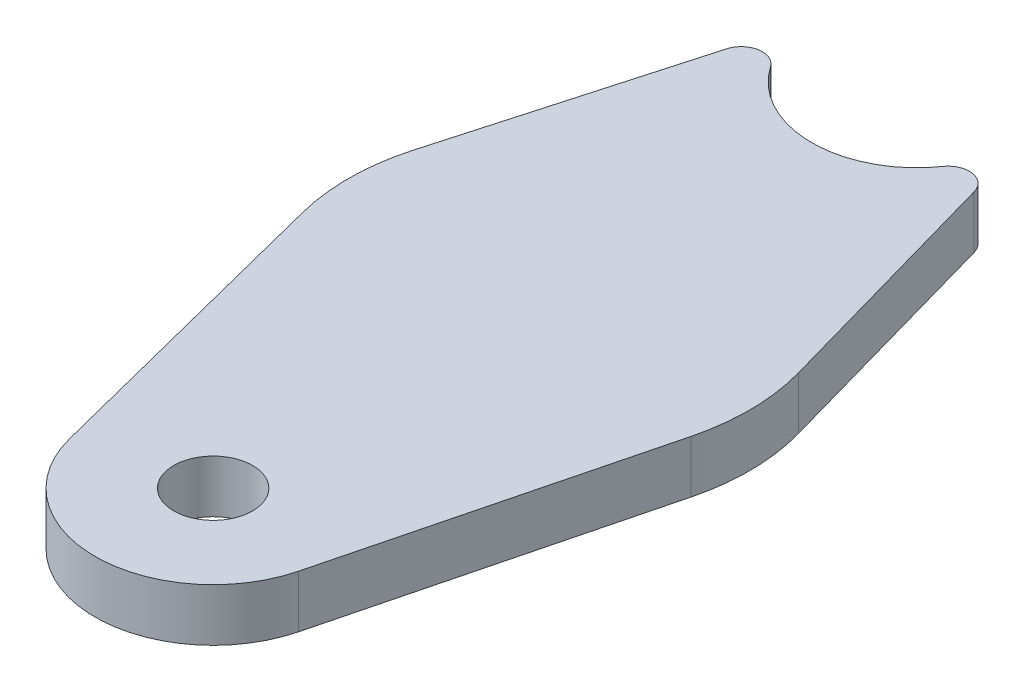
ISO-10303-21;
HEADER;
FILE_DESCRIPTION(('STEP AP214'),'2;1');
FILE_NAME('part.step','',(''),(''),'','','');
FILE_SCHEMA(('AUTOMOTIVE_DESIGN { 1 0 10303 214 1 1 1 1 }'));
ENDSEC;
DATA;
#1=APPLICATION_CONTEXT('core data for automotive mechanical design processes');
#2=APPLICATION_PROTOCOL_DEFINITION('international standard','automotive_design',2000,#1);
#3=PRODUCT_CONTEXT('',#1,'mechanical');
#4=PRODUCT('Part','Part','',(#3));
#5=PRODUCT_RELATED_PRODUCT_CATEGORY('part','',(#4));
#6=PRODUCT_DEFINITION_FORMATION('','',#4);
#7=PRODUCT_DEFINITION_CONTEXT('part definition',#1,'design');
#8=PRODUCT_DEFINITION('design','',#6,#7);
#9=PRODUCT_DEFINITION_SHAPE('','',#8);
#10=(LENGTH_UNIT() NAMED_UNIT(*) SI_UNIT(.MILLI.,.METRE.));
#11=(NAMED_UNIT(*) PLANE_ANGLE_UNIT() SI_UNIT($,.RADIAN.));
#12=(NAMED_UNIT(*) SI_UNIT($,.STERADIAN.) SOLID_ANGLE_UNIT());
#13=UNCERTAINTY_MEASURE_WITH_UNIT(LENGTH_MEASURE(1.E-05),#10,'distance_accuracy_value','');
#14=(GEOMETRIC_REPRESENTATION_CONTEXT(3) GLOBAL_UNCERTAINTY_ASSIGNED_CONTEXT((#13)) GLOBAL_UNIT_ASSIGNED_CONTEXT((#10,
#11,#12)) REPRESENTATION_CONTEXT('',''));
#15=CARTESIAN_POINT('',(0.,0.,0.));
#16=DIRECTION('',(0.,0.,1.));
#17=DIRECTION('',(1.,0.,0.));
#18=AXIS2_PLACEMENT_3D('',#15,#16,#17);
#19=CARTESIAN_POINT('',(0.,6.35,30.6260952694673));
#20=DIRECTION('',(0.,-1.,0.));
#21=DIRECTION('',(0.,0.,-1.));
#22=AXIS2_PLACEMENT_3D('',#19,#20,#21);
#23=PLANE('',#22);
#24=DIRECTION('',(0.246282727535613,0.,-0.969198028329412));
#25=VECTOR('',#24,1.);
#26=CARTESIAN_POINT('',(25.1377929163927,6.35,-10.2862311122674));
#27=LINE('',#26,#25);
#28=CARTESIAN_POINT('',(13.8474168297565,6.35,34.1448597391324));
#29=VERTEX_POINT('',#28);
#30=CARTESIAN_POINT('',(23.461614964389,6.35,-3.68995705575111));
#31=VERTEX_POINT('',#30);
#32=EDGE_CURVE('E163',#29,#31,#27,.T.);
#33=ORIENTED_EDGE('',*,*,#32,.T.);
#34=CARTESIAN_POINT('',(-1.15601495517809,6.35,-9.94553833515567));
#35=DIRECTION('',(0.,-1.,0.));
#36=DIRECTION('',(0.,0.,-1.));
#37=AXIS2_PLACEMENT_3D('',#34,#35,#36);
#38=CIRCLE('',#37,25.4);
#39=CARTESIAN_POINT('',(23.2912685758331,6.35,-16.8368609915365));
#40=VERTEX_POINT('',#39);
#41=EDGE_CURVE('E232',#31,#40,#38,.F.);
#42=ORIENTED_EDGE('',*,*,#41,.T.);
#43=DIRECTION('',(-0.271311915605545,0.,-0.962491477598867));
#44=VECTOR('',#43,1.);
#45=CARTESIAN_POINT('',(12.7,6.35,-54.4098725507521));
#46=LINE('',#45,#44);
#47=CARTESIAN_POINT('',(14.9579364847158,6.35,-46.3997392005526));
#48=VERTEX_POINT('',#47);
#49=EDGE_CURVE('E167',#40,#48,#46,.T.);
#50=ORIENTED_EDGE('',*,*,#49,.T.);
#51=CARTESIAN_POINT('',(12.5132081316146,6.35,-45.7106069349146));
#52=DIRECTION('',(0.,-1.,0.));
#53=DIRECTION('',(0.,0.,-1.));
#54=AXIS2_PLACEMENT_3D('',#51,#52,#53);
#55=CIRCLE('',#54,2.54);
#56=CARTESIAN_POINT('',(10.4276734430122,6.35,-47.1604845375541));
#57=VERTEX_POINT('',#56);
#58=EDGE_CURVE('E210',#48,#57,#55,.F.);
#59=ORIENTED_EDGE('',*,*,#58,.T.);
#60=CARTESIAN_POINT('',(0.,6.35,-54.4098725507521));
#61=DIRECTION('',(0.,1.,0.));
#62=DIRECTION('',(0.,0.,1.));
#63=AXIS2_PLACEMENT_3D('',#60,#61,#62);
#64=CIRCLE('',#63,12.7);
#65=CARTESIAN_POINT('',(-10.4276734430122,6.35,-47.1604845375541));
#66=VERTEX_POINT('',#65);
#67=EDGE_CURVE('E262',#66,#57,#64,.T.);
#68=ORIENTED_EDGE('',*,*,#67,.F.);
#69=CARTESIAN_POINT('',(-12.5132081316147,6.35,-45.7106069349145));
#70=DIRECTION('',(0.,-1.,0.));
#71=DIRECTION('',(0.,0.,-1.));
#72=AXIS2_PLACEMENT_3D('',#69,#70,#71);
#73=CIRCLE('',#72,2.54);
#74=CARTESIAN_POINT('',(-14.9579364847158,6.35,-46.3997392005526));
#75=VERTEX_POINT('',#74);
#76=EDGE_CURVE('E207',#66,#75,#73,.F.);
#77=ORIENTED_EDGE('',*,*,#76,.T.);
#78=DIRECTION('',(-0.271311915605545,0.,0.962491477598867));
#79=VECTOR('',#78,1.);
#80=CARTESIAN_POINT('',(-12.7,6.35,-54.4098725507521));
#81=LINE('',#80,#79);
#82=CARTESIAN_POINT('',(-23.2912685758331,6.35,-16.8368609915365));
#83=VERTEX_POINT('',#82);
#84=EDGE_CURVE('E146',#75,#83,#81,.T.);
#85=ORIENTED_EDGE('',*,*,#84,.T.);
#86=CARTESIAN_POINT('',(1.15601495517808,6.35,-9.94553833515567));
#87=DIRECTION('',(0.,-1.,0.));
#88=DIRECTION('',(0.,0.,-1.));
#89=AXIS2_PLACEMENT_3D('',#86,#87,#88);
#90=CIRCLE('',#89,25.4);
#91=CARTESIAN_POINT('',(-23.461614964389,6.35,-3.68995705575111));
#92=VERTEX_POINT('',#91);
#93=EDGE_CURVE('E63',#83,#92,#90,.F.);
#94=ORIENTED_EDGE('',*,*,#93,.T.);
#95=DIRECTION('',(0.246282727535613,0.,0.969198028329412));
#96=VECTOR('',#95,1.);
#97=CARTESIAN_POINT('',(-25.1377929163927,6.35,-10.2862311122674));
#98=LINE('',#97,#96);
#99=CARTESIAN_POINT('',(-13.8474168297565,6.35,34.1448597391324));
#100=VERTEX_POINT('',#99);
#101=EDGE_CURVE('E135',#92,#100,#98,.T.);
#102=ORIENTED_EDGE('',*,*,#101,.T.);
#103=CARTESIAN_POINT('',(0.,6.35,30.6260952694673));
#104=DIRECTION('',(0.,1.,0.));
#105=DIRECTION('',(0.,0.,-1.));
#106=AXIS2_PLACEMENT_3D('',#103,#104,#105);
#107=CIRCLE('',#106,14.2875);
#108=EDGE_CURVE('E140',#100,#29,#107,.T.);
#109=ORIENTED_EDGE('',*,*,#108,.T.);
#110=EDGE_LOOP('',(#33,#42,#50,#59,#68,#77,#85,#94,#102,#109));
#111=FACE_BOUND('',#110,.T.);
#112=CARTESIAN_POINT('',(0.,6.35,30.6260952694673));
#113=DIRECTION('',(0.,1.,0.));
#114=DIRECTION('',(0.,0.,1.));
#115=AXIS2_PLACEMENT_3D('',#112,#113,#114);
#116=CIRCLE('',#115,4.7625);
#117=CARTESIAN_POINT('',(0.,6.35,35.3885952694673));
#118=VERTEX_POINT('',#117);
#119=EDGE_CURVE('E176',#118,#118,#116,.T.);
#120=ORIENTED_EDGE('',*,*,#119,.F.);
#121=EDGE_LOOP('',(#120));
#122=FACE_BOUND('',#121,.T.);
#123=ADVANCED_FACE('F47',(#111,#122),#23,.F.);
#124=CARTESIAN_POINT('',(0.,0.,30.6260952694673));
#125=DIRECTION('',(0.,-1.,0.));
#126=DIRECTION('',(0.,0.,-1.));
#127=AXIS2_PLACEMENT_3D('',#124,#125,#126);
#128=PLANE('',#127);
#129=DIRECTION('',(-0.271311915605545,0.,-0.962491477598867));
#130=VECTOR('',#129,1.);
#131=CARTESIAN_POINT('',(12.7,0.,-54.4098725507521));
#132=LINE('',#131,#130);
#133=CARTESIAN_POINT('',(23.2912685758331,0.,-16.8368609915365));
#134=VERTEX_POINT('',#133);
#135=CARTESIAN_POINT('',(14.9579364847158,0.,-46.3997392005526));
#136=VERTEX_POINT('',#135);
#137=EDGE_CURVE('E186',#134,#136,#132,.T.);
#138=ORIENTED_EDGE('',*,*,#137,.F.);
#139=CARTESIAN_POINT('',(-1.15601495517809,0.,-9.94553833515567));
#140=DIRECTION('',(0.,-1.,0.));
#141=DIRECTION('',(0.,0.,-1.));
#142=AXIS2_PLACEMENT_3D('',#139,#140,#141);
#143=CIRCLE('',#142,25.4);
#144=CARTESIAN_POINT('',(23.461614964389,0.,-3.68995705575111));
#145=VERTEX_POINT('',#144);
#146=EDGE_CURVE('E224',#134,#145,#143,.T.);
#147=ORIENTED_EDGE('',*,*,#146,.T.);
#148=DIRECTION('',(0.246282727535613,0.,-0.969198028329412));
#149=VECTOR('',#148,1.);
#150=CARTESIAN_POINT('',(25.1377929163927,0.,-10.2862311122674));
#151=LINE('',#150,#149);
#152=CARTESIAN_POINT('',(13.8474168297565,0.,34.1448597391324));
#153=VERTEX_POINT('',#152);
#154=EDGE_CURVE('E182',#153,#145,#151,.T.);
#155=ORIENTED_EDGE('',*,*,#154,.F.);
#156=CARTESIAN_POINT('',(0.,0.,30.6260952694673));
#157=DIRECTION('',(0.,1.,0.));
#158=DIRECTION('',(0.,0.,-1.));
#159=AXIS2_PLACEMENT_3D('',#156,#157,#158);
#160=CIRCLE('',#159,14.2875);
#161=CARTESIAN_POINT('',(-13.8474168297565,0.,34.1448597391324));
#162=VERTEX_POINT('',#161);
#163=EDGE_CURVE('E179',#162,#153,#160,.T.);
#164=ORIENTED_EDGE('',*,*,#163,.F.);
#165=DIRECTION('',(0.246282727535613,0.,0.969198028329412));
#166=VECTOR('',#165,1.);
#167=CARTESIAN_POINT('',(-25.1377929163927,0.,-10.2862311122674));
#168=LINE('',#167,#166);
#169=CARTESIAN_POINT('',(-23.461614964389,0.,-3.68995705575111));
#170=VERTEX_POINT('',#169);
#171=EDGE_CURVE('E152',#170,#162,#168,.T.);
#172=ORIENTED_EDGE('',*,*,#171,.F.);
#173=CARTESIAN_POINT('',(1.15601495517808,0.,-9.94553833515567));
#174=DIRECTION('',(0.,-1.,0.));
#175=DIRECTION('',(0.,0.,-1.));
#176=AXIS2_PLACEMENT_3D('',#173,#174,#175);
#177=CIRCLE('',#176,25.4);
#178=CARTESIAN_POINT('',(-23.2912685758331,0.,-16.8368609915365));
#179=VERTEX_POINT('',#178);
#180=EDGE_CURVE('E221',#170,#179,#177,.T.);
#181=ORIENTED_EDGE('',*,*,#180,.T.);
#182=DIRECTION('',(-0.271311915605545,0.,0.962491477598867));
#183=VECTOR('',#182,1.);
#184=CARTESIAN_POINT('',(-12.7,0.,-54.4098725507521));
#185=LINE('',#184,#183);
#186=CARTESIAN_POINT('',(-14.9579364847158,0.,-46.3997392005526));
#187=VERTEX_POINT('',#186);
#188=EDGE_CURVE('E173',#187,#179,#185,.T.);
#189=ORIENTED_EDGE('',*,*,#188,.F.);
#190=CARTESIAN_POINT('',(-12.5132081316147,0.,-45.7106069349145));
#191=DIRECTION('',(0.,-1.,0.));
#192=DIRECTION('',(0.,0.,-1.));
#193=AXIS2_PLACEMENT_3D('',#190,#191,#192);
#194=CIRCLE('',#193,2.54);
#195=CARTESIAN_POINT('',(-10.4276734430122,0.,-47.1604845375541));
#196=VERTEX_POINT('',#195);
#197=EDGE_CURVE('E196',#187,#196,#194,.T.);
#198=ORIENTED_EDGE('',*,*,#197,.T.);
#199=CARTESIAN_POINT('',(0.,0.,-54.4098725507521));
#200=DIRECTION('',(0.,-1.,0.));
#201=DIRECTION('',(0.,0.,-1.));
#202=AXIS2_PLACEMENT_3D('',#199,#200,#201);
#203=CIRCLE('',#202,12.7);
#204=CARTESIAN_POINT('',(10.4276734430122,0.,-47.1604845375541));
#205=VERTEX_POINT('',#204);
#206=EDGE_CURVE('E255',#205,#196,#203,.T.);
#207=ORIENTED_EDGE('',*,*,#206,.F.);
#208=CARTESIAN_POINT('',(12.5132081316146,0.,-45.7106069349146));
#209=DIRECTION('',(0.,-1.,0.));
#210=DIRECTION('',(0.,0.,-1.));
#211=AXIS2_PLACEMENT_3D('',#208,#209,#210);
#212=CIRCLE('',#211,2.54);
#213=EDGE_CURVE('E199',#205,#136,#212,.T.);
#214=ORIENTED_EDGE('',*,*,#213,.T.);
#215=EDGE_LOOP('',(#138,#147,#155,#164,#172,#181,#189,#198,#207,#214));
#216=FACE_BOUND('',#215,.T.);
#217=CARTESIAN_POINT('',(0.,0.,30.6260952694673));
#218=DIRECTION('',(0.,1.,0.));
#219=DIRECTION('',(0.,0.,1.));
#220=AXIS2_PLACEMENT_3D('',#217,#218,#219);
#221=CIRCLE('',#220,4.7625);
#222=CARTESIAN_POINT('',(0.,0.,35.3885952694673));
#223=VERTEX_POINT('',#222);
#224=EDGE_CURVE('E270',#223,#223,#221,.T.);
#225=ORIENTED_EDGE('',*,*,#224,.T.);
#226=EDGE_LOOP('',(#225));
#227=FACE_BOUND('',#226,.T.);
#228=ADVANCED_FACE('F238',(#216,#227),#128,.T.);
#229=CARTESIAN_POINT('',(-12.7,6.35,-54.4098725507521));
#230=DIRECTION('',(0.962491477598866,0.,0.271311915605545));
#231=DIRECTION('',(0.271311915605545,0.,-0.962491477598867));
#232=AXIS2_PLACEMENT_3D('',#229,#230,#231);
#233=PLANE('',#232);
#234=ORIENTED_EDGE('',*,*,#188,.T.);
#235=DIRECTION('',(0.,-1.,0.));
#236=VECTOR('',#235,1.);
#237=CARTESIAN_POINT('',(-23.2912685758331,6.35,-16.8368609915365));
#238=LINE('',#237,#236);
#239=EDGE_CURVE('E11',#179,#83,#238,.F.);
#240=ORIENTED_EDGE('',*,*,#239,.T.);
#241=ORIENTED_EDGE('',*,*,#84,.F.);
#242=DIRECTION('',(0.,1.,0.));
#243=VECTOR('',#242,1.);
#244=CARTESIAN_POINT('',(-14.9579364847158,6.35,-46.3997392005526));
#245=LINE('',#244,#243);
#246=EDGE_CURVE('E213',#75,#187,#245,.F.);
#247=ORIENTED_EDGE('',*,*,#246,.T.);
#248=EDGE_LOOP('',(#234,#240,#241,#247));
#249=FACE_BOUND('',#248,.T.);
#250=ADVANCED_FACE('F291',(#249),#233,.F.);
#251=CARTESIAN_POINT('',(-25.1377929163927,6.35,-10.2862311122674));
#252=DIRECTION('',(0.969198028329412,0.,-0.246282727535613));
#253=DIRECTION('',(-0.246282727535613,0.,-0.969198028329412));
#254=AXIS2_PLACEMENT_3D('',#251,#252,#253);
#255=PLANE('',#254);
#256=ORIENTED_EDGE('',*,*,#101,.F.);
#257=DIRECTION('',(0.,-1.,0.));
#258=VECTOR('',#257,1.);
#259=CARTESIAN_POINT('',(-23.461614964389,6.35,-3.68995705575111));
#260=LINE('',#259,#258);
#261=EDGE_CURVE('E56',#92,#170,#260,.T.);
#262=ORIENTED_EDGE('',*,*,#261,.T.);
#263=ORIENTED_EDGE('',*,*,#171,.T.);
#264=DIRECTION('',(0.,-1.,0.));
#265=VECTOR('',#264,1.);
#266=CARTESIAN_POINT('',(-13.8474168297565,6.35,34.1448597391324));
#267=LINE('',#266,#265);
#268=EDGE_CURVE('E149',#100,#162,#267,.T.);
#269=ORIENTED_EDGE('',*,*,#268,.F.);
#270=EDGE_LOOP('',(#256,#262,#263,#269));
#271=FACE_BOUND('',#270,.T.);
#272=ADVANCED_FACE('F150',(#271),#255,.F.);
#273=CARTESIAN_POINT('',(0.,6.35,30.6260952694673));
#274=DIRECTION('',(0.,-1.,0.));
#275=DIRECTION('',(0.,0.,-1.));
#276=AXIS2_PLACEMENT_3D('',#273,#274,#275);
#277=CYLINDRICAL_SURFACE('',#276,14.2875);
#278=ORIENTED_EDGE('',*,*,#163,.T.);
#279=DIRECTION('',(0.,-1.,0.));
#280=VECTOR('',#279,1.);
#281=CARTESIAN_POINT('',(13.8474168297565,6.35,34.1448597391324));
#282=LINE('',#281,#280);
#283=EDGE_CURVE('E157',#29,#153,#282,.T.);
#284=ORIENTED_EDGE('',*,*,#283,.F.);
#285=ORIENTED_EDGE('',*,*,#108,.F.);
#286=ORIENTED_EDGE('',*,*,#268,.T.);
#287=EDGE_LOOP('',(#278,#284,#285,#286));
#288=FACE_BOUND('',#287,.T.);
#289=ADVANCED_FACE('F159',(#288),#277,.T.);
#290=CARTESIAN_POINT('',(25.1377929163927,6.35,-10.2862311122674));
#291=DIRECTION('',(-0.969198028329412,0.,-0.246282727535613));
#292=DIRECTION('',(-0.246282727535613,0.,0.969198028329412));
#293=AXIS2_PLACEMENT_3D('',#290,#291,#292);
#294=PLANE('',#293);
#295=ORIENTED_EDGE('',*,*,#154,.T.);
#296=DIRECTION('',(0.,-1.,0.));
#297=VECTOR('',#296,1.);
#298=CARTESIAN_POINT('',(23.461614964389,6.35,-3.68995705575111));
#299=LINE('',#298,#297);
#300=EDGE_CURVE('E227',#145,#31,#299,.F.);
#301=ORIENTED_EDGE('',*,*,#300,.T.);
#302=ORIENTED_EDGE('',*,*,#32,.F.);
#303=ORIENTED_EDGE('',*,*,#283,.T.);
#304=EDGE_LOOP('',(#295,#301,#302,#303));
#305=FACE_BOUND('',#304,.T.);
#306=ADVANCED_FACE('F243',(#305),#294,.F.);
#307=CARTESIAN_POINT('',(12.7,6.35,-54.4098725507521));
#308=DIRECTION('',(-0.962491477598866,0.,0.271311915605545));
#309=DIRECTION('',(0.271311915605545,0.,0.962491477598867));
#310=AXIS2_PLACEMENT_3D('',#307,#308,#309);
#311=PLANE('',#310);
#312=ORIENTED_EDGE('',*,*,#49,.F.);
#313=DIRECTION('',(0.,-1.,0.));
#314=VECTOR('',#313,1.);
#315=CARTESIAN_POINT('',(23.2912685758331,6.35,-16.8368609915365));
#316=LINE('',#315,#314);
#317=EDGE_CURVE('E217',#40,#134,#316,.T.);
#318=ORIENTED_EDGE('',*,*,#317,.T.);
#319=ORIENTED_EDGE('',*,*,#137,.T.);
#320=DIRECTION('',(0.,1.,0.));
#321=VECTOR('',#320,1.);
#322=CARTESIAN_POINT('',(14.9579364847158,6.35,-46.3997392005526));
#323=LINE('',#322,#321);
#324=EDGE_CURVE('E203',#136,#48,#323,.T.);
#325=ORIENTED_EDGE('',*,*,#324,.T.);
#326=EDGE_LOOP('',(#312,#318,#319,#325));
#327=FACE_BOUND('',#326,.T.);
#328=ADVANCED_FACE('F251',(#327),#311,.F.);
#329=CARTESIAN_POINT('',(0.,6.35,30.6260952694673));
#330=DIRECTION('',(0.,-1.,0.));
#331=DIRECTION('',(0.,0.,-1.));
#332=AXIS2_PLACEMENT_3D('',#329,#330,#331);
#333=CYLINDRICAL_SURFACE('',#332,4.7625);
#334=ORIENTED_EDGE('',*,*,#119,.T.);
#335=EDGE_LOOP('',(#334));
#336=FACE_BOUND('',#335,.T.);
#337=ORIENTED_EDGE('',*,*,#224,.F.);
#338=EDGE_LOOP('',(#337));
#339=FACE_BOUND('',#338,.T.);
#340=ADVANCED_FACE('F294',(#336,#339),#333,.F.);
#341=CARTESIAN_POINT('',(0.,-1.2E-05,-54.4098725507521));
#342=DIRECTION('',(0.,1.,0.));
#343=DIRECTION('',(0.,0.,1.));
#344=AXIS2_PLACEMENT_3D('',#341,#342,#343);
#345=CYLINDRICAL_SURFACE('',#344,12.7);
#346=ORIENTED_EDGE('',*,*,#67,.T.);
#347=DIRECTION('',(0.,1.,0.));
#348=VECTOR('',#347,1.);
#349=CARTESIAN_POINT('',(10.4276734430122,-1.2E-05,-47.1604845375541));
#350=LINE('',#349,#348);
#351=EDGE_CURVE('E192',#57,#205,#350,.F.);
#352=ORIENTED_EDGE('',*,*,#351,.T.);
#353=ORIENTED_EDGE('',*,*,#206,.T.);
#354=DIRECTION('',(0.,1.,0.));
#355=VECTOR('',#354,1.);
#356=CARTESIAN_POINT('',(-10.4276734430122,-1.2E-05,-47.1604845375541));
#357=LINE('',#356,#355);
#358=EDGE_CURVE('E156',#196,#66,#357,.T.);
#359=ORIENTED_EDGE('',*,*,#358,.T.);
#360=EDGE_LOOP('',(#346,#352,#353,#359));
#361=FACE_BOUND('',#360,.T.);
#362=ADVANCED_FACE('F265',(#361),#345,.F.);
#363=CARTESIAN_POINT('',(12.5132081316146,-1.2E-05,-45.7106069349146));
#364=DIRECTION('',(0.,1.,0.));
#365=DIRECTION('',(0.,0.,1.));
#366=AXIS2_PLACEMENT_3D('',#363,#364,#365);
#367=CYLINDRICAL_SURFACE('',#366,2.54);
#368=ORIENTED_EDGE('',*,*,#58,.F.);
#369=ORIENTED_EDGE('',*,*,#324,.F.);
#370=ORIENTED_EDGE('',*,*,#213,.F.);
#371=ORIENTED_EDGE('',*,*,#351,.F.);
#372=EDGE_LOOP('',(#368,#369,#370,#371));
#373=FACE_BOUND('',#372,.T.);
#374=ADVANCED_FACE('F259',(#373),#367,.T.);
#375=CARTESIAN_POINT('',(-12.5132081316147,-1.2E-05,-45.7106069349145));
#376=DIRECTION('',(0.,1.,0.));
#377=DIRECTION('',(0.,0.,1.));
#378=AXIS2_PLACEMENT_3D('',#375,#376,#377);
#379=CYLINDRICAL_SURFACE('',#378,2.54);
#380=ORIENTED_EDGE('',*,*,#76,.F.);
#381=ORIENTED_EDGE('',*,*,#358,.F.);
#382=ORIENTED_EDGE('',*,*,#197,.F.);
#383=ORIENTED_EDGE('',*,*,#246,.F.);
#384=EDGE_LOOP('',(#380,#381,#382,#383));
#385=FACE_BOUND('',#384,.T.);
#386=ADVANCED_FACE('F284',(#385),#379,.T.);
#387=CARTESIAN_POINT('',(-1.15601495517809,6.35,-9.94553833515567));
#388=DIRECTION('',(0.,-1.,0.));
#389=DIRECTION('',(0.,0.,-1.));
#390=AXIS2_PLACEMENT_3D('',#387,#388,#389);
#391=CYLINDRICAL_SURFACE('',#390,25.4);
#392=ORIENTED_EDGE('',*,*,#41,.F.);
#393=ORIENTED_EDGE('',*,*,#300,.F.);
#394=ORIENTED_EDGE('',*,*,#146,.F.);
#395=ORIENTED_EDGE('',*,*,#317,.F.);
#396=EDGE_LOOP('',(#392,#393,#394,#395));
#397=FACE_BOUND('',#396,.T.);
#398=ADVANCED_FACE('F249',(#397),#391,.T.);
#399=CARTESIAN_POINT('',(1.15601495517808,6.35,-9.94553833515567));
#400=DIRECTION('',(0.,-1.,0.));
#401=DIRECTION('',(0.,0.,-1.));
#402=AXIS2_PLACEMENT_3D('',#399,#400,#401);
#403=CYLINDRICAL_SURFACE('',#402,25.4);
#404=ORIENTED_EDGE('',*,*,#93,.F.);
#405=ORIENTED_EDGE('',*,*,#239,.F.);
#406=ORIENTED_EDGE('',*,*,#180,.F.);
#407=ORIENTED_EDGE('',*,*,#261,.F.);
#408=EDGE_LOOP('',(#404,#405,#406,#407));
#409=FACE_BOUND('',#408,.T.);
#410=ADVANCED_FACE('F49',(#409),#403,.T.);
#411=CLOSED_SHELL('',(#123,#228,#250,#272,#289,#306,#328,#340,#362,#374,#386,#398,#410));
#412=MANIFOLD_SOLID_BREP('B2',#411);
#413=ADVANCED_BREP_SHAPE_REPRESENTATION('',(#18,#412),#14);
#414=SHAPE_DEFINITION_REPRESENTATION(#9,#413);
ENDSEC;
END-ISO-10303-21;
